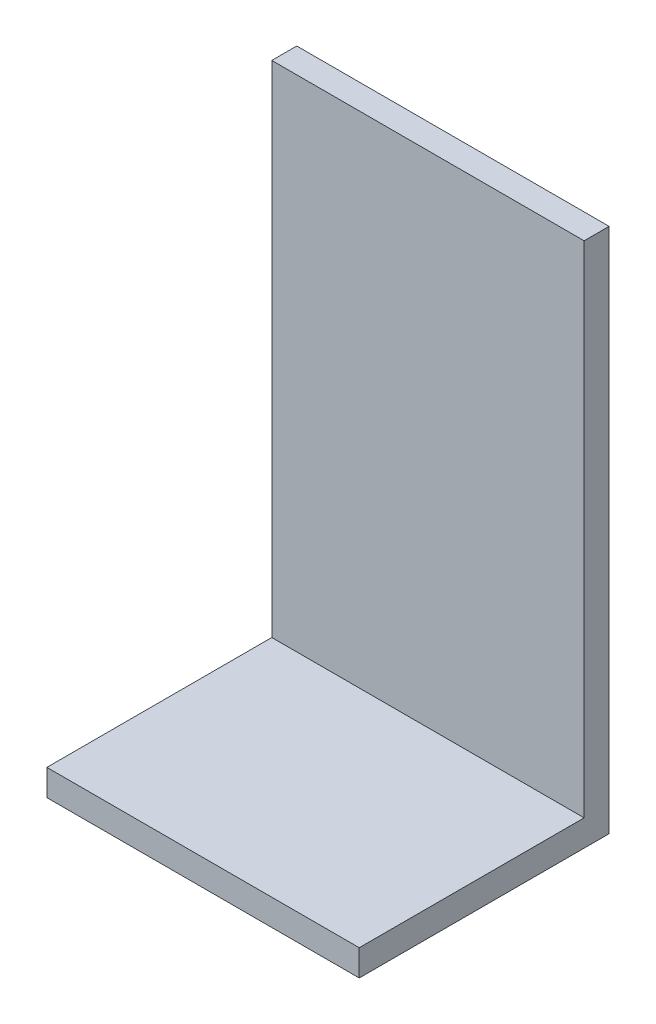
ISO-10303-21;
HEADER;
FILE_DESCRIPTION(('STEP AP214'),'2;1');
FILE_NAME('part.step','',(''),(''),'','','');
FILE_SCHEMA(('AUTOMOTIVE_DESIGN { 1 0 10303 214 1 1 1 1 }'));
ENDSEC;
DATA;
#1=APPLICATION_CONTEXT('core data for automotive mechanical design processes');
#2=APPLICATION_PROTOCOL_DEFINITION('international standard','automotive_design',2000,#1);
#3=PRODUCT_CONTEXT('',#1,'mechanical');
#4=PRODUCT('Part','Part','',(#3));
#5=PRODUCT_RELATED_PRODUCT_CATEGORY('part','',(#4));
#6=PRODUCT_DEFINITION_FORMATION('','',#4);
#7=PRODUCT_DEFINITION_CONTEXT('part definition',#1,'design');
#8=PRODUCT_DEFINITION('design','',#6,#7);
#9=PRODUCT_DEFINITION_SHAPE('','',#8);
#10=(LENGTH_UNIT() NAMED_UNIT(*) SI_UNIT(.MILLI.,.METRE.));
#11=(NAMED_UNIT(*) PLANE_ANGLE_UNIT() SI_UNIT($,.RADIAN.));
#12=(NAMED_UNIT(*) SI_UNIT($,.STERADIAN.) SOLID_ANGLE_UNIT());
#13=UNCERTAINTY_MEASURE_WITH_UNIT(LENGTH_MEASURE(1.E-05),#10,'distance_accuracy_value','');
#14=(GEOMETRIC_REPRESENTATION_CONTEXT(3) GLOBAL_UNCERTAINTY_ASSIGNED_CONTEXT((#13)) GLOBAL_UNIT_ASSIGNED_CONTEXT((#10,
#11,#12)) REPRESENTATION_CONTEXT('',''));
#15=CARTESIAN_POINT('',(0.,0.,0.));
#16=DIRECTION('',(0.,0.,1.));
#17=DIRECTION('',(1.,0.,0.));
#18=AXIS2_PLACEMENT_3D('',#15,#16,#17);
#19=CARTESIAN_POINT('',(-0.27832069959543,-1.5105,0.2));
#20=DIRECTION('',(0.,0.,1.));
#21=DIRECTION('',(0.,-1.,0.));
#22=AXIS2_PLACEMENT_3D('',#19,#20,#21);
#23=PLANE('',#22);
#24=DIRECTION('',(1.,0.,0.));
#25=VECTOR('',#24,1.);
#26=CARTESIAN_POINT('',(-0.27832069959543,-1.521,0.2));
#27=LINE('',#26,#25);
#28=CARTESIAN_POINT('',(-0.40332069959543,-1.521,0.2));
#29=VERTEX_POINT('',#28);
#30=CARTESIAN_POINT('',(-0.15332069959543,-1.521,0.2));
#31=VERTEX_POINT('',#30);
#32=EDGE_CURVE('E78',#29,#31,#27,.T.);
#33=ORIENTED_EDGE('',*,*,#32,.T.);
#34=DIRECTION('',(0.,-1.,0.));
#35=VECTOR('',#34,1.);
#36=CARTESIAN_POINT('',(-0.153320699595431,-1.36847101449275,0.2));
#37=LINE('',#36,#35);
#38=CARTESIAN_POINT('',(-0.15332069959543,-1.5,0.2));
#39=VERTEX_POINT('',#38);
#40=EDGE_CURVE('E105',#39,#31,#37,.T.);
#41=ORIENTED_EDGE('',*,*,#40,.F.);
#42=DIRECTION('',(1.,0.,0.));
#43=VECTOR('',#42,1.);
#44=CARTESIAN_POINT('',(-0.27832069959543,-1.5,0.2));
#45=LINE('',#44,#43);
#46=CARTESIAN_POINT('',(-0.403320699595431,-1.5,0.2));
#47=VERTEX_POINT('',#46);
#48=EDGE_CURVE('E11',#47,#39,#45,.T.);
#49=ORIENTED_EDGE('',*,*,#48,.F.);
#50=DIRECTION('',(0.,-1.,0.));
#51=VECTOR('',#50,1.);
#52=CARTESIAN_POINT('',(-0.40332069959543,-1.36847101449276,0.2));
#53=LINE('',#52,#51);
#54=EDGE_CURVE('E74',#47,#29,#53,.T.);
#55=ORIENTED_EDGE('',*,*,#54,.T.);
#56=EDGE_LOOP('',(#33,#41,#49,#55));
#57=FACE_BOUND('',#56,.T.);
#58=ADVANCED_FACE('F17',(#57),#23,.T.);
#59=CARTESIAN_POINT('',(-0.27832069959543,-1.5,0.11));
#60=DIRECTION('',(0.,1.,0.));
#61=DIRECTION('',(1.,0.,0.));
#62=AXIS2_PLACEMENT_3D('',#59,#60,#61);
#63=PLANE('',#62);
#64=DIRECTION('',(0.,0.,1.));
#65=VECTOR('',#64,1.);
#66=CARTESIAN_POINT('',(-0.40332069959543,-1.5,0.0420289855072462));
#67=LINE('',#66,#65);
#68=CARTESIAN_POINT('',(-0.403320699595432,-1.5,0.02));
#69=VERTEX_POINT('',#68);
#70=EDGE_CURVE('E83',#69,#47,#67,.T.);
#71=ORIENTED_EDGE('',*,*,#70,.T.);
#72=ORIENTED_EDGE('',*,*,#48,.T.);
#73=DIRECTION('',(0.,0.,1.));
#74=VECTOR('',#73,1.);
#75=CARTESIAN_POINT('',(-0.15332069959543,-1.5,0.0420289855072459));
#76=LINE('',#75,#74);
#77=CARTESIAN_POINT('',(-0.15332069959543,-1.5,0.02));
#78=VERTEX_POINT('',#77);
#79=EDGE_CURVE('E123',#78,#39,#76,.T.);
#80=ORIENTED_EDGE('',*,*,#79,.F.);
#81=DIRECTION('',(1.,0.,0.));
#82=VECTOR('',#81,1.);
#83=CARTESIAN_POINT('',(-0.27832069959543,-1.5,0.02));
#84=LINE('',#83,#82);
#85=EDGE_CURVE('E26',#69,#78,#84,.T.);
#86=ORIENTED_EDGE('',*,*,#85,.F.);
#87=EDGE_LOOP('',(#71,#72,#80,#86));
#88=FACE_BOUND('',#87,.T.);
#89=ADVANCED_FACE('F124',(#88),#63,.T.);
#90=CARTESIAN_POINT('',(-0.27832069959543,-1.3,0.02));
#91=DIRECTION('',(0.,0.,1.));
#92=DIRECTION('',(0.,-1.,0.));
#93=AXIS2_PLACEMENT_3D('',#90,#91,#92);
#94=PLANE('',#93);
#95=DIRECTION('',(0.,-1.,0.));
#96=VECTOR('',#95,1.);
#97=CARTESIAN_POINT('',(-0.153320699595431,-1.36847101449275,0.02));
#98=LINE('',#97,#96);
#99=CARTESIAN_POINT('',(-0.153320699595431,-1.1,0.02));
#100=VERTEX_POINT('',#99);
#101=EDGE_CURVE('E120',#100,#78,#98,.T.);
#102=ORIENTED_EDGE('',*,*,#101,.F.);
#103=DIRECTION('',(1.,0.,0.));
#104=VECTOR('',#103,1.);
#105=CARTESIAN_POINT('',(-0.278320699595433,-1.1,0.02));
#106=LINE('',#105,#104);
#107=CARTESIAN_POINT('',(-0.403320699595432,-1.1,0.02));
#108=VERTEX_POINT('',#107);
#109=EDGE_CURVE('E134',#108,#100,#106,.T.);
#110=ORIENTED_EDGE('',*,*,#109,.F.);
#111=DIRECTION('',(0.,-1.,0.));
#112=VECTOR('',#111,1.);
#113=CARTESIAN_POINT('',(-0.40332069959543,-1.36847101449276,0.02));
#114=LINE('',#113,#112);
#115=EDGE_CURVE('E110',#108,#69,#114,.T.);
#116=ORIENTED_EDGE('',*,*,#115,.T.);
#117=ORIENTED_EDGE('',*,*,#85,.T.);
#118=EDGE_LOOP('',(#102,#110,#116,#117));
#119=FACE_BOUND('',#118,.T.);
#120=ADVANCED_FACE('F117',(#119),#94,.T.);
#121=CARTESIAN_POINT('',(-0.40332069959543,-1.36847101449276,0.0420289855072462));
#122=DIRECTION('',(1.,0.,0.));
#123=DIRECTION('',(0.,1.,0.));
#124=AXIS2_PLACEMENT_3D('',#121,#122,#123);
#125=PLANE('',#124);
#126=DIRECTION('',(0.,0.,1.));
#127=VECTOR('',#126,1.);
#128=CARTESIAN_POINT('',(-0.403320699595431,-1.521,0.0999999999999988));
#129=LINE('',#128,#127);
#130=CARTESIAN_POINT('',(-0.403320699595431,-1.521,0.));
#131=VERTEX_POINT('',#130);
#132=EDGE_CURVE('E84',#131,#29,#129,.T.);
#133=ORIENTED_EDGE('',*,*,#132,.T.);
#134=ORIENTED_EDGE('',*,*,#54,.F.);
#135=ORIENTED_EDGE('',*,*,#70,.F.);
#136=ORIENTED_EDGE('',*,*,#115,.F.);
#137=DIRECTION('',(0.,0.,1.));
#138=VECTOR('',#137,1.);
#139=CARTESIAN_POINT('',(-0.403320699595433,-1.1,0.01));
#140=LINE('',#139,#138);
#141=CARTESIAN_POINT('',(-0.403320699595432,-1.1,0.));
#142=VERTEX_POINT('',#141);
#143=EDGE_CURVE('E139',#142,#108,#140,.T.);
#144=ORIENTED_EDGE('',*,*,#143,.F.);
#145=DIRECTION('',(0.,-1.,0.));
#146=VECTOR('',#145,1.);
#147=CARTESIAN_POINT('',(-0.403320699595433,-1.3105,0.));
#148=LINE('',#147,#146);
#149=EDGE_CURVE('E89',#142,#131,#148,.T.);
#150=ORIENTED_EDGE('',*,*,#149,.T.);
#151=EDGE_LOOP('',(#133,#134,#135,#136,#144,#150));
#152=FACE_BOUND('',#151,.T.);
#153=ADVANCED_FACE('F87',(#152),#125,.F.);
#154=CARTESIAN_POINT('',(-0.27832069959543,-1.521,0.0999999999999988));
#155=DIRECTION('',(0.,1.,0.));
#156=DIRECTION('',(1.,0.,0.));
#157=AXIS2_PLACEMENT_3D('',#154,#155,#156);
#158=PLANE('',#157);
#159=DIRECTION('',(1.,0.,0.));
#160=VECTOR('',#159,1.);
#161=CARTESIAN_POINT('',(-0.27832069959543,-1.521,0.));
#162=LINE('',#161,#160);
#163=CARTESIAN_POINT('',(-0.15332069959543,-1.521,0.));
#164=VERTEX_POINT('',#163);
#165=EDGE_CURVE('E153',#131,#164,#162,.T.);
#166=ORIENTED_EDGE('',*,*,#165,.T.);
#167=DIRECTION('',(0.,0.,-1.));
#168=VECTOR('',#167,1.);
#169=CARTESIAN_POINT('',(-0.15332069959543,-1.521,0.0420289855072459));
#170=LINE('',#169,#168);
#171=EDGE_CURVE('E97',#31,#164,#170,.T.);
#172=ORIENTED_EDGE('',*,*,#171,.F.);
#173=ORIENTED_EDGE('',*,*,#32,.F.);
#174=ORIENTED_EDGE('',*,*,#132,.F.);
#175=EDGE_LOOP('',(#166,#172,#173,#174));
#176=FACE_BOUND('',#175,.T.);
#177=ADVANCED_FACE('F95',(#176),#158,.F.);
#178=CARTESIAN_POINT('',(-0.153320699595431,-1.36847101449275,0.0420289855072459));
#179=DIRECTION('',(1.,0.,0.));
#180=DIRECTION('',(0.,1.,0.));
#181=AXIS2_PLACEMENT_3D('',#178,#179,#180);
#182=PLANE('',#181);
#183=ORIENTED_EDGE('',*,*,#101,.T.);
#184=ORIENTED_EDGE('',*,*,#79,.T.);
#185=ORIENTED_EDGE('',*,*,#40,.T.);
#186=ORIENTED_EDGE('',*,*,#171,.T.);
#187=DIRECTION('',(0.,1.,0.));
#188=VECTOR('',#187,1.);
#189=CARTESIAN_POINT('',(-0.15332069959543,-1.3105,0.));
#190=LINE('',#189,#188);
#191=CARTESIAN_POINT('',(-0.153320699595432,-1.1,0.));
#192=VERTEX_POINT('',#191);
#193=EDGE_CURVE('E157',#164,#192,#190,.T.);
#194=ORIENTED_EDGE('',*,*,#193,.T.);
#195=DIRECTION('',(0.,0.,-1.));
#196=VECTOR('',#195,1.);
#197=CARTESIAN_POINT('',(-0.153320699595432,-1.1,0.01));
#198=LINE('',#197,#196);
#199=EDGE_CURVE('E132',#100,#192,#198,.T.);
#200=ORIENTED_EDGE('',*,*,#199,.F.);
#201=EDGE_LOOP('',(#183,#184,#185,#186,#194,#200));
#202=FACE_BOUND('',#201,.T.);
#203=ADVANCED_FACE('F129',(#202),#182,.T.);
#204=CARTESIAN_POINT('',(-0.278320699595433,-1.1,0.01));
#205=DIRECTION('',(0.,1.,0.));
#206=DIRECTION('',(1.,0.,0.));
#207=AXIS2_PLACEMENT_3D('',#204,#205,#206);
#208=PLANE('',#207);
#209=ORIENTED_EDGE('',*,*,#199,.T.);
#210=DIRECTION('',(-1.,0.,0.));
#211=VECTOR('',#210,1.);
#212=CARTESIAN_POINT('',(-0.27832069959543,-1.1,0.));
#213=LINE('',#212,#211);
#214=EDGE_CURVE('E142',#192,#142,#213,.T.);
#215=ORIENTED_EDGE('',*,*,#214,.T.);
#216=ORIENTED_EDGE('',*,*,#143,.T.);
#217=ORIENTED_EDGE('',*,*,#109,.T.);
#218=EDGE_LOOP('',(#209,#215,#216,#217));
#219=FACE_BOUND('',#218,.T.);
#220=ADVANCED_FACE('F286',(#219),#208,.T.);
#221=CARTESIAN_POINT('',(-0.27832069959543,-1.3105,0.));
#222=DIRECTION('',(0.,0.,1.));
#223=DIRECTION('',(0.,-1.,0.));
#224=AXIS2_PLACEMENT_3D('',#221,#222,#223);
#225=PLANE('',#224);
#226=ORIENTED_EDGE('',*,*,#193,.F.);
#227=ORIENTED_EDGE('',*,*,#165,.F.);
#228=ORIENTED_EDGE('',*,*,#149,.F.);
#229=ORIENTED_EDGE('',*,*,#214,.F.);
#230=EDGE_LOOP('',(#226,#227,#228,#229));
#231=FACE_BOUND('',#230,.T.);
#232=ADVANCED_FACE('F165',(#231),#225,.F.);
#233=CLOSED_SHELL('',(#58,#89,#120,#153,#177,#203,#220,#232));
#234=MANIFOLD_SOLID_BREP('B1',#233);
#235=ADVANCED_BREP_SHAPE_REPRESENTATION('',(#18,#234),#14);
#236=SHAPE_DEFINITION_REPRESENTATION(#9,#235);
ENDSEC;
END-ISO-10303-21;
